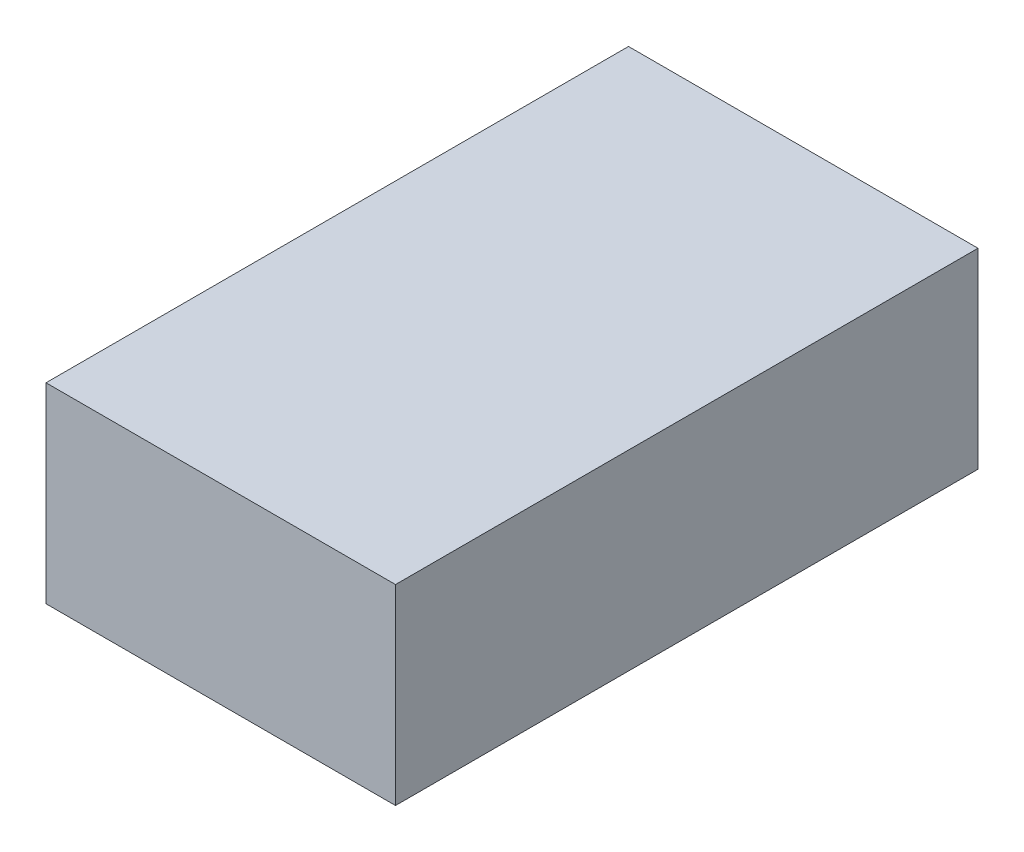
ISO-10303-21;
HEADER;
FILE_DESCRIPTION(('STEP AP214'),'2;1');
FILE_NAME('part.step','',(''),(''),'','','');
FILE_SCHEMA(('AUTOMOTIVE_DESIGN { 1 0 10303 214 1 1 1 1 }'));
ENDSEC;
DATA;
#1=APPLICATION_CONTEXT('core data for automotive mechanical design processes');
#2=APPLICATION_PROTOCOL_DEFINITION('international standard','automotive_design',2000,#1);
#3=PRODUCT_CONTEXT('',#1,'mechanical');
#4=PRODUCT('Part','Part','',(#3));
#5=PRODUCT_RELATED_PRODUCT_CATEGORY('part','',(#4));
#6=PRODUCT_DEFINITION_FORMATION('','',#4);
#7=PRODUCT_DEFINITION_CONTEXT('part definition',#1,'design');
#8=PRODUCT_DEFINITION('design','',#6,#7);
#9=PRODUCT_DEFINITION_SHAPE('','',#8);
#10=(LENGTH_UNIT() NAMED_UNIT(*) SI_UNIT(.MILLI.,.METRE.));
#11=(NAMED_UNIT(*) PLANE_ANGLE_UNIT() SI_UNIT($,.RADIAN.));
#12=(NAMED_UNIT(*) SI_UNIT($,.STERADIAN.) SOLID_ANGLE_UNIT());
#13=UNCERTAINTY_MEASURE_WITH_UNIT(LENGTH_MEASURE(1.E-05),#10,'distance_accuracy_value','');
#14=(GEOMETRIC_REPRESENTATION_CONTEXT(3) GLOBAL_UNCERTAINTY_ASSIGNED_CONTEXT((#13)) GLOBAL_UNIT_ASSIGNED_CONTEXT((#10,
#11,#12)) REPRESENTATION_CONTEXT('',''));
#15=CARTESIAN_POINT('',(0.,0.,0.));
#16=DIRECTION('',(0.,0.,1.));
#17=DIRECTION('',(1.,0.,0.));
#18=AXIS2_PLACEMENT_3D('',#15,#16,#17);
#19=CARTESIAN_POINT('',(10.5,11.5,17.5));
#20=DIRECTION('',(-1.,0.,0.));
#21=DIRECTION('',(0.,0.,1.));
#22=AXIS2_PLACEMENT_3D('',#19,#20,#21);
#23=PLANE('',#22);
#24=DIRECTION('',(0.,0.,-1.));
#25=VECTOR('',#24,1.);
#26=CARTESIAN_POINT('',(10.5,0.,17.5));
#27=LINE('',#26,#25);
#28=CARTESIAN_POINT('',(10.5,0.,17.5));
#29=VERTEX_POINT('',#28);
#30=CARTESIAN_POINT('',(10.5,0.,-17.5));
#31=VERTEX_POINT('',#30);
#32=EDGE_CURVE('E98',#29,#31,#27,.T.);
#33=ORIENTED_EDGE('',*,*,#32,.T.);
#34=DIRECTION('',(0.,-1.,0.));
#35=VECTOR('',#34,1.);
#36=CARTESIAN_POINT('',(10.5,11.5,-17.5));
#37=LINE('',#36,#35);
#38=CARTESIAN_POINT('',(10.5,11.5,-17.5));
#39=VERTEX_POINT('',#38);
#40=EDGE_CURVE('E11',#39,#31,#37,.T.);
#41=ORIENTED_EDGE('',*,*,#40,.F.);
#42=DIRECTION('',(0.,0.,-1.));
#43=VECTOR('',#42,1.);
#44=CARTESIAN_POINT('',(10.5,11.5,17.5));
#45=LINE('',#44,#43);
#46=CARTESIAN_POINT('',(10.5,11.5,17.5));
#47=VERTEX_POINT('',#46);
#48=EDGE_CURVE('E86',#47,#39,#45,.T.);
#49=ORIENTED_EDGE('',*,*,#48,.F.);
#50=DIRECTION('',(0.,-1.,0.));
#51=VECTOR('',#50,1.);
#52=CARTESIAN_POINT('',(10.5,11.5,17.5));
#53=LINE('',#52,#51);
#54=EDGE_CURVE('E94',#47,#29,#53,.T.);
#55=ORIENTED_EDGE('',*,*,#54,.T.);
#56=EDGE_LOOP('',(#33,#41,#49,#55));
#57=FACE_BOUND('',#56,.T.);
#58=ADVANCED_FACE('F35',(#57),#23,.F.);
#59=CARTESIAN_POINT('',(-10.5,11.5,-17.5));
#60=DIRECTION('',(0.,0.,1.));
#61=DIRECTION('',(1.,0.,0.));
#62=AXIS2_PLACEMENT_3D('',#59,#60,#61);
#63=PLANE('',#62);
#64=DIRECTION('',(-1.,0.,0.));
#65=VECTOR('',#64,1.);
#66=CARTESIAN_POINT('',(-10.5,0.,-17.5));
#67=LINE('',#66,#65);
#68=CARTESIAN_POINT('',(-10.5,0.,-17.5));
#69=VERTEX_POINT('',#68);
#70=EDGE_CURVE('E90',#31,#69,#67,.T.);
#71=ORIENTED_EDGE('',*,*,#70,.T.);
#72=DIRECTION('',(0.,-1.,0.));
#73=VECTOR('',#72,1.);
#74=CARTESIAN_POINT('',(-10.5,11.5,-17.5));
#75=LINE('',#74,#73);
#76=CARTESIAN_POINT('',(-10.5,11.5,-17.5));
#77=VERTEX_POINT('',#76);
#78=EDGE_CURVE('E43',#77,#69,#75,.T.);
#79=ORIENTED_EDGE('',*,*,#78,.F.);
#80=DIRECTION('',(-1.,0.,0.));
#81=VECTOR('',#80,1.);
#82=CARTESIAN_POINT('',(-10.5,11.5,-17.5));
#83=LINE('',#82,#81);
#84=EDGE_CURVE('E81',#39,#77,#83,.T.);
#85=ORIENTED_EDGE('',*,*,#84,.F.);
#86=ORIENTED_EDGE('',*,*,#40,.T.);
#87=EDGE_LOOP('',(#71,#79,#85,#86));
#88=FACE_BOUND('',#87,.T.);
#89=ADVANCED_FACE('F89',(#88),#63,.F.);
#90=CARTESIAN_POINT('',(-10.5,11.5,17.5));
#91=DIRECTION('',(1.,0.,0.));
#92=DIRECTION('',(0.,0.,-1.));
#93=AXIS2_PLACEMENT_3D('',#90,#91,#92);
#94=PLANE('',#93);
#95=DIRECTION('',(0.,0.,1.));
#96=VECTOR('',#95,1.);
#97=CARTESIAN_POINT('',(-10.5,0.,17.5));
#98=LINE('',#97,#96);
#99=CARTESIAN_POINT('',(-10.5,0.,17.5));
#100=VERTEX_POINT('',#99);
#101=EDGE_CURVE('E68',#69,#100,#98,.T.);
#102=ORIENTED_EDGE('',*,*,#101,.T.);
#103=DIRECTION('',(0.,-1.,0.));
#104=VECTOR('',#103,1.);
#105=CARTESIAN_POINT('',(-10.5,11.5,17.5));
#106=LINE('',#105,#104);
#107=CARTESIAN_POINT('',(-10.5,11.5,17.5));
#108=VERTEX_POINT('',#107);
#109=EDGE_CURVE('E91',#108,#100,#106,.T.);
#110=ORIENTED_EDGE('',*,*,#109,.F.);
#111=DIRECTION('',(0.,0.,1.));
#112=VECTOR('',#111,1.);
#113=CARTESIAN_POINT('',(-10.5,11.5,17.5));
#114=LINE('',#113,#112);
#115=EDGE_CURVE('E84',#77,#108,#114,.T.);
#116=ORIENTED_EDGE('',*,*,#115,.F.);
#117=ORIENTED_EDGE('',*,*,#78,.T.);
#118=EDGE_LOOP('',(#102,#110,#116,#117));
#119=FACE_BOUND('',#118,.T.);
#120=ADVANCED_FACE('F92',(#119),#94,.F.);
#121=CARTESIAN_POINT('',(-10.5,11.5,17.5));
#122=DIRECTION('',(0.,0.,-1.));
#123=DIRECTION('',(-1.,0.,0.));
#124=AXIS2_PLACEMENT_3D('',#121,#122,#123);
#125=PLANE('',#124);
#126=DIRECTION('',(1.,0.,0.));
#127=VECTOR('',#126,1.);
#128=CARTESIAN_POINT('',(-10.5,0.,17.5));
#129=LINE('',#128,#127);
#130=EDGE_CURVE('E74',#100,#29,#129,.T.);
#131=ORIENTED_EDGE('',*,*,#130,.T.);
#132=ORIENTED_EDGE('',*,*,#54,.F.);
#133=DIRECTION('',(1.,0.,0.));
#134=VECTOR('',#133,1.);
#135=CARTESIAN_POINT('',(-10.5,11.5,17.5));
#136=LINE('',#135,#134);
#137=EDGE_CURVE('E51',#108,#47,#136,.T.);
#138=ORIENTED_EDGE('',*,*,#137,.F.);
#139=ORIENTED_EDGE('',*,*,#109,.T.);
#140=EDGE_LOOP('',(#131,#132,#138,#139));
#141=FACE_BOUND('',#140,.T.);
#142=ADVANCED_FACE('F105',(#141),#125,.F.);
#143=CARTESIAN_POINT('',(0.,11.5,0.));
#144=DIRECTION('',(0.,-1.,0.));
#145=DIRECTION('',(0.,0.,-1.));
#146=AXIS2_PLACEMENT_3D('',#143,#144,#145);
#147=PLANE('',#146);
#148=ORIENTED_EDGE('',*,*,#48,.T.);
#149=ORIENTED_EDGE('',*,*,#84,.T.);
#150=ORIENTED_EDGE('',*,*,#115,.T.);
#151=ORIENTED_EDGE('',*,*,#137,.T.);
#152=EDGE_LOOP('',(#148,#149,#150,#151));
#153=FACE_BOUND('',#152,.T.);
#154=ADVANCED_FACE('F82',(#153),#147,.F.);
#155=CARTESIAN_POINT('',(0.,0.,0.));
#156=DIRECTION('',(0.,-1.,0.));
#157=DIRECTION('',(0.,0.,-1.));
#158=AXIS2_PLACEMENT_3D('',#155,#156,#157);
#159=PLANE('',#158);
#160=ORIENTED_EDGE('',*,*,#32,.F.);
#161=ORIENTED_EDGE('',*,*,#130,.F.);
#162=ORIENTED_EDGE('',*,*,#101,.F.);
#163=ORIENTED_EDGE('',*,*,#70,.F.);
#164=EDGE_LOOP('',(#160,#161,#162,#163));
#165=FACE_BOUND('',#164,.T.);
#166=ADVANCED_FACE('F108',(#165),#159,.T.);
#167=CLOSED_SHELL('',(#58,#89,#120,#142,#154,#166));
#168=MANIFOLD_SOLID_BREP('B2',#167);
#169=ADVANCED_BREP_SHAPE_REPRESENTATION('',(#18,#168),#14);
#170=SHAPE_DEFINITION_REPRESENTATION(#9,#169);
ENDSEC;
END-ISO-10303-21;
